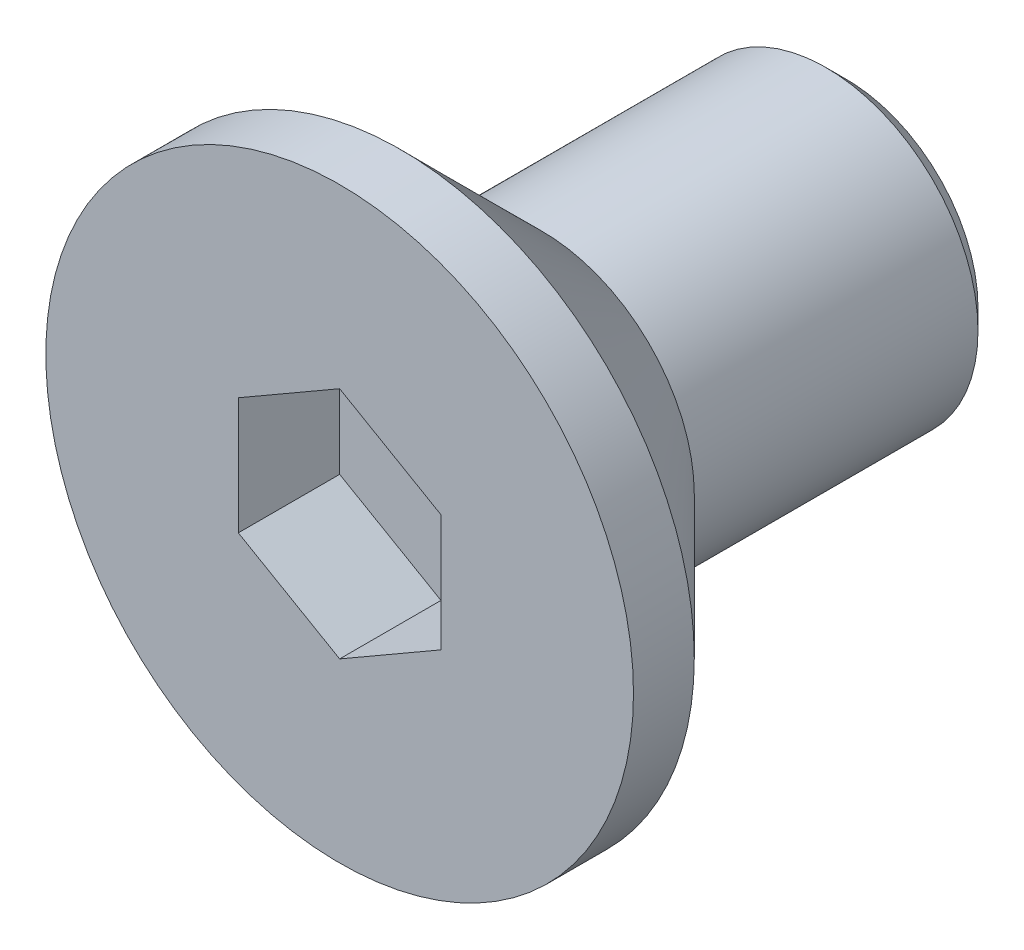
ISO-10303-21;
HEADER;
FILE_DESCRIPTION(('STEP AP214'),'2;1');
FILE_NAME('part.step','',(''),(''),'','','');
FILE_SCHEMA(('AUTOMOTIVE_DESIGN { 1 0 10303 214 1 1 1 1 }'));
ENDSEC;
DATA;
#1=APPLICATION_CONTEXT('core data for automotive mechanical design processes');
#2=APPLICATION_PROTOCOL_DEFINITION('international standard','automotive_design',2000,#1);
#3=PRODUCT_CONTEXT('',#1,'mechanical');
#4=PRODUCT('Part','Part','',(#3));
#5=PRODUCT_RELATED_PRODUCT_CATEGORY('part','',(#4));
#6=PRODUCT_DEFINITION_FORMATION('','',#4);
#7=PRODUCT_DEFINITION_CONTEXT('part definition',#1,'design');
#8=PRODUCT_DEFINITION('design','',#6,#7);
#9=PRODUCT_DEFINITION_SHAPE('','',#8);
#10=(LENGTH_UNIT() NAMED_UNIT(*) SI_UNIT(.MILLI.,.METRE.));
#11=(NAMED_UNIT(*) PLANE_ANGLE_UNIT() SI_UNIT($,.RADIAN.));
#12=(NAMED_UNIT(*) SI_UNIT($,.STERADIAN.) SOLID_ANGLE_UNIT());
#13=UNCERTAINTY_MEASURE_WITH_UNIT(LENGTH_MEASURE(1.E-05),#10,'distance_accuracy_value','');
#14=(GEOMETRIC_REPRESENTATION_CONTEXT(3) GLOBAL_UNCERTAINTY_ASSIGNED_CONTEXT((#13)) GLOBAL_UNIT_ASSIGNED_CONTEXT((#10,
#11,#12)) REPRESENTATION_CONTEXT('',''));
#15=CARTESIAN_POINT('',(0.,0.,0.));
#16=DIRECTION('',(0.,0.,1.));
#17=DIRECTION('',(1.,0.,0.));
#18=AXIS2_PLACEMENT_3D('',#15,#16,#17);
#19=CARTESIAN_POINT('',(0.,0.,0.));
#20=DIRECTION('',(0.,0.,-1.));
#21=DIRECTION('',(-1.,0.,0.));
#22=AXIS2_PLACEMENT_3D('',#19,#20,#21);
#23=PLANE('',#22);
#24=DIRECTION('',(0.,1.,0.));
#25=VECTOR('',#24,1.);
#26=CARTESIAN_POINT('',(1.,-0.577350269189626,0.));
#27=LINE('',#26,#25);
#28=CARTESIAN_POINT('',(1.,-0.577350269189626,0.));
#29=VERTEX_POINT('',#28);
#30=CARTESIAN_POINT('',(1.,0.577350269189626,0.));
#31=VERTEX_POINT('',#30);
#32=EDGE_CURVE('E125',#29,#31,#27,.T.);
#33=ORIENTED_EDGE('',*,*,#32,.F.);
#34=DIRECTION('',(0.866025403784439,0.5,0.));
#35=VECTOR('',#34,1.);
#36=CARTESIAN_POINT('',(0.,-1.15470053837925,0.));
#37=LINE('',#36,#35);
#38=CARTESIAN_POINT('',(0.,-1.15470053837925,0.));
#39=VERTEX_POINT('',#38);
#40=EDGE_CURVE('E51',#39,#29,#37,.T.);
#41=ORIENTED_EDGE('',*,*,#40,.F.);
#42=DIRECTION('',(0.866025403784439,-0.5,0.));
#43=VECTOR('',#42,1.);
#44=CARTESIAN_POINT('',(-1.,-0.577350269189626,0.));
#45=LINE('',#44,#43);
#46=CARTESIAN_POINT('',(-1.,-0.577350269189626,0.));
#47=VERTEX_POINT('',#46);
#48=EDGE_CURVE('E134',#47,#39,#45,.T.);
#49=ORIENTED_EDGE('',*,*,#48,.F.);
#50=DIRECTION('',(0.,-1.,0.));
#51=VECTOR('',#50,1.);
#52=CARTESIAN_POINT('',(-1.,0.577350269189626,0.));
#53=LINE('',#52,#51);
#54=CARTESIAN_POINT('',(-1.,0.577350269189626,0.));
#55=VERTEX_POINT('',#54);
#56=EDGE_CURVE('E132',#55,#47,#53,.T.);
#57=ORIENTED_EDGE('',*,*,#56,.F.);
#58=DIRECTION('',(-0.866025403784439,-0.5,0.));
#59=VECTOR('',#58,1.);
#60=CARTESIAN_POINT('',(0.,1.15470053837925,0.));
#61=LINE('',#60,#59);
#62=CARTESIAN_POINT('',(0.,1.15470053837925,0.));
#63=VERTEX_POINT('',#62);
#64=EDGE_CURVE('E99',#63,#55,#61,.T.);
#65=ORIENTED_EDGE('',*,*,#64,.F.);
#66=DIRECTION('',(-0.866025403784439,0.5,0.));
#67=VECTOR('',#66,1.);
#68=CARTESIAN_POINT('',(1.,0.577350269189626,0.));
#69=LINE('',#68,#67);
#70=EDGE_CURVE('E128',#31,#63,#69,.T.);
#71=ORIENTED_EDGE('',*,*,#70,.F.);
#72=EDGE_LOOP('',(#33,#41,#49,#57,#65,#71));
#73=FACE_BOUND('',#72,.T.);
#74=CARTESIAN_POINT('',(0.,0.,0.));
#75=DIRECTION('',(0.,0.,1.));
#76=DIRECTION('',(1.,0.,0.));
#77=AXIS2_PLACEMENT_3D('',#74,#75,#76);
#78=CIRCLE('',#77,2.9);
#79=CARTESIAN_POINT('',(2.9,0.,0.));
#80=VERTEX_POINT('',#79);
#81=EDGE_CURVE('E149',#80,#80,#78,.T.);
#82=ORIENTED_EDGE('',*,*,#81,.T.);
#83=EDGE_LOOP('',(#82));
#84=FACE_BOUND('',#83,.T.);
#85=ADVANCED_FACE('F36',(#73,#84),#23,.F.);
#86=CARTESIAN_POINT('',(0.,0.,31.7635815070186));
#87=DIRECTION('',(0.,0.,1.));
#88=DIRECTION('',(1.,0.,0.));
#89=AXIS2_PLACEMENT_3D('',#86,#87,#88);
#90=CYLINDRICAL_SURFACE('',#89,2.9);
#91=ORIENTED_EDGE('',*,*,#81,.F.);
#92=EDGE_LOOP('',(#91));
#93=FACE_BOUND('',#92,.T.);
#94=CARTESIAN_POINT('',(0.,0.,-0.60000000000001));
#95=DIRECTION('',(0.,0.,1.));
#96=DIRECTION('',(1.,0.,0.));
#97=AXIS2_PLACEMENT_3D('',#94,#95,#96);
#98=CIRCLE('',#97,2.9);
#99=CARTESIAN_POINT('',(2.9,0.,-0.60000000000001));
#100=VERTEX_POINT('',#99);
#101=EDGE_CURVE('E146',#100,#100,#98,.T.);
#102=ORIENTED_EDGE('',*,*,#101,.T.);
#103=EDGE_LOOP('',(#102));
#104=FACE_BOUND('',#103,.T.);
#105=ADVANCED_FACE('F166',(#93,#104),#90,.T.);
#106=CARTESIAN_POINT('',(0.,0.,-2.));
#107=DIRECTION('',(0.,0.,1.));
#108=DIRECTION('',(1.,0.,0.));
#109=AXIS2_PLACEMENT_3D('',#106,#107,#108);
#110=CONICAL_SURFACE('',#109,1.5,0.785398163397451);
#111=ORIENTED_EDGE('',*,*,#101,.F.);
#112=EDGE_LOOP('',(#111));
#113=FACE_BOUND('',#112,.T.);
#114=CARTESIAN_POINT('',(0.,0.,-2.));
#115=DIRECTION('',(0.,0.,1.));
#116=DIRECTION('',(1.,0.,0.));
#117=AXIS2_PLACEMENT_3D('',#114,#115,#116);
#118=CIRCLE('',#117,1.5);
#119=CARTESIAN_POINT('',(1.5,0.,-2.));
#120=VERTEX_POINT('',#119);
#121=EDGE_CURVE('E138',#120,#120,#118,.T.);
#122=ORIENTED_EDGE('',*,*,#121,.T.);
#123=EDGE_LOOP('',(#122));
#124=FACE_BOUND('',#123,.T.);
#125=ADVANCED_FACE('F171',(#113,#124),#110,.T.);
#126=CARTESIAN_POINT('',(0.,0.,31.7635815070186));
#127=DIRECTION('',(0.,0.,1.));
#128=DIRECTION('',(1.,0.,0.));
#129=AXIS2_PLACEMENT_3D('',#126,#127,#128);
#130=CYLINDRICAL_SURFACE('',#129,1.5);
#131=CARTESIAN_POINT('',(0.,0.,-4.8));
#132=DIRECTION('',(0.,0.,1.));
#133=DIRECTION('',(1.,0.,0.));
#134=AXIS2_PLACEMENT_3D('',#131,#132,#133);
#135=CIRCLE('',#134,1.5);
#136=CARTESIAN_POINT('',(1.5,0.,-4.8));
#137=VERTEX_POINT('',#136);
#138=EDGE_CURVE('E44',#137,#137,#135,.T.);
#139=ORIENTED_EDGE('',*,*,#138,.T.);
#140=EDGE_LOOP('',(#139));
#141=FACE_BOUND('',#140,.T.);
#142=ORIENTED_EDGE('',*,*,#121,.F.);
#143=EDGE_LOOP('',(#142));
#144=FACE_BOUND('',#143,.T.);
#145=ADVANCED_FACE('F154',(#141,#144),#130,.T.);
#146=CARTESIAN_POINT('',(0.,1.5,-5.));
#147=DIRECTION('',(0.,0.,1.));
#148=DIRECTION('',(1.,0.,0.));
#149=AXIS2_PLACEMENT_3D('',#146,#147,#148);
#150=PLANE('',#149);
#151=CARTESIAN_POINT('',(0.,0.,-5.));
#152=DIRECTION('',(0.,0.,1.));
#153=DIRECTION('',(1.,0.,0.));
#154=AXIS2_PLACEMENT_3D('',#151,#152,#153);
#155=CIRCLE('',#154,1.3);
#156=CARTESIAN_POINT('',(1.3,0.,-5.));
#157=VERTEX_POINT('',#156);
#158=EDGE_CURVE('E11',#157,#157,#155,.F.);
#159=ORIENTED_EDGE('',*,*,#158,.T.);
#160=EDGE_LOOP('',(#159));
#161=FACE_BOUND('',#160,.T.);
#162=ADVANCED_FACE('F182',(#161),#150,.F.);
#163=CARTESIAN_POINT('',(0.,-1.15470053837925,-1.));
#164=DIRECTION('',(0.5,-0.866025403784439,0.));
#165=DIRECTION('',(0.866025403784439,0.5,0.));
#166=AXIS2_PLACEMENT_3D('',#163,#164,#165);
#167=PLANE('',#166);
#168=ORIENTED_EDGE('',*,*,#40,.T.);
#169=DIRECTION('',(0.,0.,1.));
#170=VECTOR('',#169,1.);
#171=CARTESIAN_POINT('',(1.,-0.577350269189626,-1.));
#172=LINE('',#171,#170);
#173=CARTESIAN_POINT('',(1.,-0.577350269189626,-1.));
#174=VERTEX_POINT('',#173);
#175=EDGE_CURVE('E81',#174,#29,#172,.T.);
#176=ORIENTED_EDGE('',*,*,#175,.F.);
#177=DIRECTION('',(0.866025403784439,0.5,0.));
#178=VECTOR('',#177,1.);
#179=CARTESIAN_POINT('',(0.,-1.15470053837925,-1.));
#180=LINE('',#179,#178);
#181=CARTESIAN_POINT('',(0.,-1.15470053837925,-1.));
#182=VERTEX_POINT('',#181);
#183=EDGE_CURVE('E136',#182,#174,#180,.T.);
#184=ORIENTED_EDGE('',*,*,#183,.F.);
#185=DIRECTION('',(0.,0.,1.));
#186=VECTOR('',#185,1.);
#187=CARTESIAN_POINT('',(0.,-1.15470053837925,-1.));
#188=LINE('',#187,#186);
#189=EDGE_CURVE('E59',#182,#39,#188,.T.);
#190=ORIENTED_EDGE('',*,*,#189,.T.);
#191=EDGE_LOOP('',(#168,#176,#184,#190));
#192=FACE_BOUND('',#191,.T.);
#193=ADVANCED_FACE('F185',(#192),#167,.F.);
#194=CARTESIAN_POINT('',(-1.,-0.577350269189626,-1.));
#195=DIRECTION('',(-0.5,-0.866025403784439,0.));
#196=DIRECTION('',(0.866025403784439,-0.5,0.));
#197=AXIS2_PLACEMENT_3D('',#194,#195,#196);
#198=PLANE('',#197);
#199=ORIENTED_EDGE('',*,*,#48,.T.);
#200=ORIENTED_EDGE('',*,*,#189,.F.);
#201=DIRECTION('',(0.866025403784439,-0.5,0.));
#202=VECTOR('',#201,1.);
#203=CARTESIAN_POINT('',(-1.,-0.577350269189626,-1.));
#204=LINE('',#203,#202);
#205=CARTESIAN_POINT('',(-1.,-0.577350269189626,-1.));
#206=VERTEX_POINT('',#205);
#207=EDGE_CURVE('E111',#206,#182,#204,.T.);
#208=ORIENTED_EDGE('',*,*,#207,.F.);
#209=DIRECTION('',(0.,0.,1.));
#210=VECTOR('',#209,1.);
#211=CARTESIAN_POINT('',(-1.,-0.577350269189626,-1.));
#212=LINE('',#211,#210);
#213=EDGE_CURVE('E103',#206,#47,#212,.T.);
#214=ORIENTED_EDGE('',*,*,#213,.T.);
#215=EDGE_LOOP('',(#199,#200,#208,#214));
#216=FACE_BOUND('',#215,.T.);
#217=ADVANCED_FACE('F189',(#216),#198,.F.);
#218=CARTESIAN_POINT('',(-1.,0.577350269189626,-1.));
#219=DIRECTION('',(-1.,0.,0.));
#220=DIRECTION('',(0.,-1.,0.));
#221=AXIS2_PLACEMENT_3D('',#218,#219,#220);
#222=PLANE('',#221);
#223=ORIENTED_EDGE('',*,*,#56,.T.);
#224=ORIENTED_EDGE('',*,*,#213,.F.);
#225=DIRECTION('',(0.,-1.,0.));
#226=VECTOR('',#225,1.);
#227=CARTESIAN_POINT('',(-1.,0.577350269189626,-1.));
#228=LINE('',#227,#226);
#229=CARTESIAN_POINT('',(-1.,0.577350269189626,-1.));
#230=VERTEX_POINT('',#229);
#231=EDGE_CURVE('E107',#230,#206,#228,.T.);
#232=ORIENTED_EDGE('',*,*,#231,.F.);
#233=DIRECTION('',(0.,0.,1.));
#234=VECTOR('',#233,1.);
#235=CARTESIAN_POINT('',(-1.,0.577350269189626,-1.));
#236=LINE('',#235,#234);
#237=EDGE_CURVE('E92',#230,#55,#236,.T.);
#238=ORIENTED_EDGE('',*,*,#237,.T.);
#239=EDGE_LOOP('',(#223,#224,#232,#238));
#240=FACE_BOUND('',#239,.T.);
#241=ADVANCED_FACE('F108',(#240),#222,.F.);
#242=CARTESIAN_POINT('',(0.,1.15470053837925,-1.));
#243=DIRECTION('',(-0.5,0.866025403784439,0.));
#244=DIRECTION('',(-0.866025403784439,-0.5,0.));
#245=AXIS2_PLACEMENT_3D('',#242,#243,#244);
#246=PLANE('',#245);
#247=ORIENTED_EDGE('',*,*,#64,.T.);
#248=ORIENTED_EDGE('',*,*,#237,.F.);
#249=DIRECTION('',(-0.866025403784439,-0.5,0.));
#250=VECTOR('',#249,1.);
#251=CARTESIAN_POINT('',(0.,1.15470053837925,-1.));
#252=LINE('',#251,#250);
#253=CARTESIAN_POINT('',(0.,1.15470053837925,-1.));
#254=VERTEX_POINT('',#253);
#255=EDGE_CURVE('E96',#254,#230,#252,.T.);
#256=ORIENTED_EDGE('',*,*,#255,.F.);
#257=DIRECTION('',(0.,0.,1.));
#258=VECTOR('',#257,1.);
#259=CARTESIAN_POINT('',(0.,1.15470053837925,-1.));
#260=LINE('',#259,#258);
#261=EDGE_CURVE('E104',#254,#63,#260,.T.);
#262=ORIENTED_EDGE('',*,*,#261,.T.);
#263=EDGE_LOOP('',(#247,#248,#256,#262));
#264=FACE_BOUND('',#263,.T.);
#265=ADVANCED_FACE('F94',(#264),#246,.F.);
#266=CARTESIAN_POINT('',(1.,0.577350269189626,-1.));
#267=DIRECTION('',(0.5,0.866025403784439,0.));
#268=DIRECTION('',(-0.866025403784439,0.5,0.));
#269=AXIS2_PLACEMENT_3D('',#266,#267,#268);
#270=PLANE('',#269);
#271=ORIENTED_EDGE('',*,*,#70,.T.);
#272=ORIENTED_EDGE('',*,*,#261,.F.);
#273=DIRECTION('',(-0.866025403784439,0.5,0.));
#274=VECTOR('',#273,1.);
#275=CARTESIAN_POINT('',(1.,0.577350269189626,-1.));
#276=LINE('',#275,#274);
#277=CARTESIAN_POINT('',(1.,0.577350269189626,-1.));
#278=VERTEX_POINT('',#277);
#279=EDGE_CURVE('E117',#278,#254,#276,.T.);
#280=ORIENTED_EDGE('',*,*,#279,.F.);
#281=DIRECTION('',(0.,0.,1.));
#282=VECTOR('',#281,1.);
#283=CARTESIAN_POINT('',(1.,0.577350269189626,-1.));
#284=LINE('',#283,#282);
#285=EDGE_CURVE('E141',#278,#31,#284,.T.);
#286=ORIENTED_EDGE('',*,*,#285,.T.);
#287=EDGE_LOOP('',(#271,#272,#280,#286));
#288=FACE_BOUND('',#287,.T.);
#289=ADVANCED_FACE('F192',(#288),#270,.F.);
#290=CARTESIAN_POINT('',(1.,-0.577350269189626,-1.));
#291=DIRECTION('',(1.,0.,0.));
#292=DIRECTION('',(0.,1.,0.));
#293=AXIS2_PLACEMENT_3D('',#290,#291,#292);
#294=PLANE('',#293);
#295=ORIENTED_EDGE('',*,*,#32,.T.);
#296=ORIENTED_EDGE('',*,*,#285,.F.);
#297=DIRECTION('',(0.,1.,0.));
#298=VECTOR('',#297,1.);
#299=CARTESIAN_POINT('',(1.,-0.577350269189626,-1.));
#300=LINE('',#299,#298);
#301=EDGE_CURVE('E119',#174,#278,#300,.T.);
#302=ORIENTED_EDGE('',*,*,#301,.F.);
#303=ORIENTED_EDGE('',*,*,#175,.T.);
#304=EDGE_LOOP('',(#295,#296,#302,#303));
#305=FACE_BOUND('',#304,.T.);
#306=ADVANCED_FACE('F162',(#305),#294,.F.);
#307=CARTESIAN_POINT('',(0.,0.,-1.));
#308=DIRECTION('',(0.,0.,1.));
#309=DIRECTION('',(1.,0.,0.));
#310=AXIS2_PLACEMENT_3D('',#307,#308,#309);
#311=PLANE('',#310);
#312=ORIENTED_EDGE('',*,*,#183,.T.);
#313=ORIENTED_EDGE('',*,*,#301,.T.);
#314=ORIENTED_EDGE('',*,*,#279,.T.);
#315=ORIENTED_EDGE('',*,*,#255,.T.);
#316=ORIENTED_EDGE('',*,*,#231,.T.);
#317=ORIENTED_EDGE('',*,*,#207,.T.);
#318=EDGE_LOOP('',(#312,#313,#314,#315,#316,#317));
#319=FACE_BOUND('',#318,.T.);
#320=ADVANCED_FACE('F114',(#319),#311,.T.);
#321=CARTESIAN_POINT('',(0.,0.,-4.8));
#322=DIRECTION('',(0.,0.,1.));
#323=DIRECTION('',(1.,0.,0.));
#324=AXIS2_PLACEMENT_3D('',#321,#322,#323);
#325=CONICAL_SURFACE('',#324,1.5,0.785398163397447);
#326=ORIENTED_EDGE('',*,*,#158,.F.);
#327=EDGE_LOOP('',(#326));
#328=FACE_BOUND('',#327,.T.);
#329=ORIENTED_EDGE('',*,*,#138,.F.);
#330=EDGE_LOOP('',(#329));
#331=FACE_BOUND('',#330,.T.);
#332=ADVANCED_FACE('F38',(#328,#331),#325,.T.);
#333=CLOSED_SHELL('',(#85,#105,#125,#145,#162,#193,#217,#241,#265,#289,#306,#320,#332));
#334=MANIFOLD_SOLID_BREP('B2',#333);
#335=ADVANCED_BREP_SHAPE_REPRESENTATION('',(#18,#334),#14);
#336=SHAPE_DEFINITION_REPRESENTATION(#9,#335);
ENDSEC;
END-ISO-10303-21;
